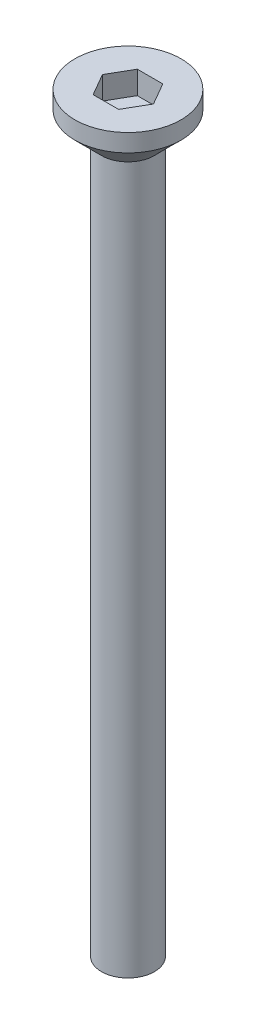
ISO-10303-21;
HEADER;
FILE_DESCRIPTION(('STEP AP214'),'2;1');
FILE_NAME('part.step','',(''),(''),'','','');
FILE_SCHEMA(('AUTOMOTIVE_DESIGN { 1 0 10303 214 1 1 1 1 }'));
ENDSEC;
DATA;
#1=APPLICATION_CONTEXT('core data for automotive mechanical design processes');
#2=APPLICATION_PROTOCOL_DEFINITION('international standard','automotive_design',2000,#1);
#3=PRODUCT_CONTEXT('',#1,'mechanical');
#4=PRODUCT('Part','Part','',(#3));
#5=PRODUCT_RELATED_PRODUCT_CATEGORY('part','',(#4));
#6=PRODUCT_DEFINITION_FORMATION('','',#4);
#7=PRODUCT_DEFINITION_CONTEXT('part definition',#1,'design');
#8=PRODUCT_DEFINITION('design','',#6,#7);
#9=PRODUCT_DEFINITION_SHAPE('','',#8);
#10=(LENGTH_UNIT() NAMED_UNIT(*) SI_UNIT(.MILLI.,.METRE.));
#11=(NAMED_UNIT(*) PLANE_ANGLE_UNIT() SI_UNIT($,.RADIAN.));
#12=(NAMED_UNIT(*) SI_UNIT($,.STERADIAN.) SOLID_ANGLE_UNIT());
#13=UNCERTAINTY_MEASURE_WITH_UNIT(LENGTH_MEASURE(1.E-05),#10,'distance_accuracy_value','');
#14=(GEOMETRIC_REPRESENTATION_CONTEXT(3) GLOBAL_UNCERTAINTY_ASSIGNED_CONTEXT((#13)) GLOBAL_UNIT_ASSIGNED_CONTEXT((#10,
#11,#12)) REPRESENTATION_CONTEXT('',''));
#15=CARTESIAN_POINT('',(0.,0.,0.));
#16=DIRECTION('',(0.,0.,1.));
#17=DIRECTION('',(1.,0.,0.));
#18=AXIS2_PLACEMENT_3D('',#15,#16,#17);
#19=CARTESIAN_POINT('',(0.,2.5,0.));
#20=DIRECTION('',(0.,-1.,0.));
#21=DIRECTION('',(0.,0.,-1.));
#22=AXIS2_PLACEMENT_3D('',#19,#20,#21);
#23=CYLINDRICAL_SURFACE('',#22,3.);
#24=CARTESIAN_POINT('',(0.,1.5,0.));
#25=DIRECTION('',(0.,1.,0.));
#26=DIRECTION('',(0.,0.,1.));
#27=AXIS2_PLACEMENT_3D('',#24,#25,#26);
#28=CIRCLE('',#27,3.);
#29=CARTESIAN_POINT('',(0.,1.5,3.));
#30=VERTEX_POINT('',#29);
#31=EDGE_CURVE('E45',#30,#30,#28,.T.);
#32=ORIENTED_EDGE('',*,*,#31,.T.);
#33=EDGE_LOOP('',(#32));
#34=FACE_BOUND('',#33,.T.);
#35=CARTESIAN_POINT('',(0.,2.5,0.));
#36=DIRECTION('',(0.,1.,0.));
#37=DIRECTION('',(0.,0.,1.));
#38=AXIS2_PLACEMENT_3D('',#35,#36,#37);
#39=CIRCLE('',#38,3.);
#40=CARTESIAN_POINT('',(0.,2.5,3.));
#41=VERTEX_POINT('',#40);
#42=EDGE_CURVE('E140',#41,#41,#39,.T.);
#43=ORIENTED_EDGE('',*,*,#42,.F.);
#44=EDGE_LOOP('',(#43));
#45=FACE_BOUND('',#44,.T.);
#46=ADVANCED_FACE('F37',(#34,#45),#23,.T.);
#47=CARTESIAN_POINT('',(0.,2.5,0.));
#48=DIRECTION('',(0.,1.,0.));
#49=DIRECTION('',(0.,0.,1.));
#50=AXIS2_PLACEMENT_3D('',#47,#48,#49);
#51=PLANE('',#50);
#52=DIRECTION('',(0.5,0.,-0.866025403784439));
#53=VECTOR('',#52,1.);
#54=CARTESIAN_POINT('',(0.721687836487032,2.5,1.25));
#55=LINE('',#54,#53);
#56=CARTESIAN_POINT('',(0.721687836487032,2.5,1.25));
#57=VERTEX_POINT('',#56);
#58=CARTESIAN_POINT('',(1.44337567297406,2.5,0.));
#59=VERTEX_POINT('',#58);
#60=EDGE_CURVE('E52',#57,#59,#55,.T.);
#61=ORIENTED_EDGE('',*,*,#60,.F.);
#62=DIRECTION('',(1.,0.,0.));
#63=VECTOR('',#62,1.);
#64=CARTESIAN_POINT('',(-0.721687836487033,2.5,1.25));
#65=LINE('',#64,#63);
#66=CARTESIAN_POINT('',(-0.721687836487033,2.5,1.25));
#67=VERTEX_POINT('',#66);
#68=EDGE_CURVE('E136',#67,#57,#65,.T.);
#69=ORIENTED_EDGE('',*,*,#68,.F.);
#70=DIRECTION('',(0.5,0.,0.866025403784439));
#71=VECTOR('',#70,1.);
#72=CARTESIAN_POINT('',(-1.44337567297407,2.5,0.));
#73=LINE('',#72,#71);
#74=CARTESIAN_POINT('',(-1.44337567297407,2.5,0.));
#75=VERTEX_POINT('',#74);
#76=EDGE_CURVE('E134',#75,#67,#73,.T.);
#77=ORIENTED_EDGE('',*,*,#76,.F.);
#78=DIRECTION('',(-0.5,0.,0.866025403784438));
#79=VECTOR('',#78,1.);
#80=CARTESIAN_POINT('',(-0.721687836487033,2.5,-1.25));
#81=LINE('',#80,#79);
#82=CARTESIAN_POINT('',(-0.721687836487033,2.5,-1.25));
#83=VERTEX_POINT('',#82);
#84=EDGE_CURVE('E100',#83,#75,#81,.T.);
#85=ORIENTED_EDGE('',*,*,#84,.F.);
#86=DIRECTION('',(-1.,0.,0.));
#87=VECTOR('',#86,1.);
#88=CARTESIAN_POINT('',(0.721687836487032,2.5,-1.25));
#89=LINE('',#88,#87);
#90=CARTESIAN_POINT('',(0.721687836487032,2.5,-1.25));
#91=VERTEX_POINT('',#90);
#92=EDGE_CURVE('E130',#91,#83,#89,.T.);
#93=ORIENTED_EDGE('',*,*,#92,.F.);
#94=DIRECTION('',(-0.5,0.,-0.866025403784439));
#95=VECTOR('',#94,1.);
#96=CARTESIAN_POINT('',(1.44337567297406,2.5,0.));
#97=LINE('',#96,#95);
#98=EDGE_CURVE('E126',#59,#91,#97,.T.);
#99=ORIENTED_EDGE('',*,*,#98,.F.);
#100=EDGE_LOOP('',(#61,#69,#77,#85,#93,#99));
#101=FACE_BOUND('',#100,.T.);
#102=ORIENTED_EDGE('',*,*,#42,.T.);
#103=EDGE_LOOP('',(#102));
#104=FACE_BOUND('',#103,.T.);
#105=ADVANCED_FACE('F154',(#101,#104),#51,.T.);
#106=CARTESIAN_POINT('',(0.,1.5,0.));
#107=DIRECTION('',(0.,1.,0.));
#108=DIRECTION('',(0.,0.,1.));
#109=AXIS2_PLACEMENT_3D('',#106,#107,#108);
#110=CONICAL_SURFACE('',#109,3.,0.78539816339745);
#111=CARTESIAN_POINT('',(0.,0.,0.));
#112=DIRECTION('',(0.,1.,0.));
#113=DIRECTION('',(0.,0.,1.));
#114=AXIS2_PLACEMENT_3D('',#111,#112,#113);
#115=CIRCLE('',#114,1.49999999999999);
#116=CARTESIAN_POINT('',(0.,0.,1.49999999999999));
#117=VERTEX_POINT('',#116);
#118=EDGE_CURVE('E11',#117,#117,#115,.F.);
#119=ORIENTED_EDGE('',*,*,#118,.F.);
#120=EDGE_LOOP('',(#119));
#121=FACE_BOUND('',#120,.T.);
#122=ORIENTED_EDGE('',*,*,#31,.F.);
#123=EDGE_LOOP('',(#122));
#124=FACE_BOUND('',#123,.T.);
#125=ADVANCED_FACE('F39',(#121,#124),#110,.T.);
#126=CARTESIAN_POINT('',(0.721687836487032,1.2,1.25));
#127=DIRECTION('',(0.866025403784439,0.,0.5));
#128=DIRECTION('',(0.5,0.,-0.866025403784439));
#129=AXIS2_PLACEMENT_3D('',#126,#127,#128);
#130=PLANE('',#129);
#131=ORIENTED_EDGE('',*,*,#60,.T.);
#132=DIRECTION('',(0.,1.,0.));
#133=VECTOR('',#132,1.);
#134=CARTESIAN_POINT('',(1.44337567297406,1.2,0.));
#135=LINE('',#134,#133);
#136=CARTESIAN_POINT('',(1.44337567297406,1.2,0.));
#137=VERTEX_POINT('',#136);
#138=EDGE_CURVE('E82',#137,#59,#135,.T.);
#139=ORIENTED_EDGE('',*,*,#138,.F.);
#140=DIRECTION('',(0.5,0.,-0.866025403784439));
#141=VECTOR('',#140,1.);
#142=CARTESIAN_POINT('',(0.721687836487032,1.2,1.25));
#143=LINE('',#142,#141);
#144=CARTESIAN_POINT('',(0.721687836487032,1.2,1.25));
#145=VERTEX_POINT('',#144);
#146=EDGE_CURVE('E138',#145,#137,#143,.T.);
#147=ORIENTED_EDGE('',*,*,#146,.F.);
#148=DIRECTION('',(0.,1.,0.));
#149=VECTOR('',#148,1.);
#150=CARTESIAN_POINT('',(0.721687836487032,1.2,1.25));
#151=LINE('',#150,#149);
#152=EDGE_CURVE('E60',#145,#57,#151,.T.);
#153=ORIENTED_EDGE('',*,*,#152,.T.);
#154=EDGE_LOOP('',(#131,#139,#147,#153));
#155=FACE_BOUND('',#154,.T.);
#156=ADVANCED_FACE('F153',(#155),#130,.F.);
#157=CARTESIAN_POINT('',(-0.721687836487033,1.2,1.25));
#158=DIRECTION('',(0.,0.,1.));
#159=DIRECTION('',(1.,0.,0.));
#160=AXIS2_PLACEMENT_3D('',#157,#158,#159);
#161=PLANE('',#160);
#162=ORIENTED_EDGE('',*,*,#68,.T.);
#163=ORIENTED_EDGE('',*,*,#152,.F.);
#164=DIRECTION('',(1.,0.,0.));
#165=VECTOR('',#164,1.);
#166=CARTESIAN_POINT('',(-0.721687836487033,1.2,1.25));
#167=LINE('',#166,#165);
#168=CARTESIAN_POINT('',(-0.721687836487033,1.2,1.25));
#169=VERTEX_POINT('',#168);
#170=EDGE_CURVE('E112',#169,#145,#167,.T.);
#171=ORIENTED_EDGE('',*,*,#170,.F.);
#172=DIRECTION('',(0.,1.,0.));
#173=VECTOR('',#172,1.);
#174=CARTESIAN_POINT('',(-0.721687836487033,1.2,1.25));
#175=LINE('',#174,#173);
#176=EDGE_CURVE('E104',#169,#67,#175,.T.);
#177=ORIENTED_EDGE('',*,*,#176,.T.);
#178=EDGE_LOOP('',(#162,#163,#171,#177));
#179=FACE_BOUND('',#178,.T.);
#180=ADVANCED_FACE('F160',(#179),#161,.F.);
#181=CARTESIAN_POINT('',(-1.44337567297407,1.2,0.));
#182=DIRECTION('',(-0.866025403784439,0.,0.5));
#183=DIRECTION('',(0.5,0.,0.866025403784439));
#184=AXIS2_PLACEMENT_3D('',#181,#182,#183);
#185=PLANE('',#184);
#186=ORIENTED_EDGE('',*,*,#76,.T.);
#187=ORIENTED_EDGE('',*,*,#176,.F.);
#188=DIRECTION('',(0.5,0.,0.866025403784439));
#189=VECTOR('',#188,1.);
#190=CARTESIAN_POINT('',(-1.44337567297407,1.2,0.));
#191=LINE('',#190,#189);
#192=CARTESIAN_POINT('',(-1.44337567297407,1.2,0.));
#193=VERTEX_POINT('',#192);
#194=EDGE_CURVE('E108',#193,#169,#191,.T.);
#195=ORIENTED_EDGE('',*,*,#194,.F.);
#196=DIRECTION('',(0.,1.,0.));
#197=VECTOR('',#196,1.);
#198=CARTESIAN_POINT('',(-1.44337567297407,1.2,0.));
#199=LINE('',#198,#197);
#200=EDGE_CURVE('E93',#193,#75,#199,.T.);
#201=ORIENTED_EDGE('',*,*,#200,.T.);
#202=EDGE_LOOP('',(#186,#187,#195,#201));
#203=FACE_BOUND('',#202,.T.);
#204=ADVANCED_FACE('F109',(#203),#185,.F.);
#205=CARTESIAN_POINT('',(-0.721687836487033,1.2,-1.25));
#206=DIRECTION('',(-0.866025403784439,0.,-0.5));
#207=DIRECTION('',(-0.5,0.,0.866025403784439));
#208=AXIS2_PLACEMENT_3D('',#205,#206,#207);
#209=PLANE('',#208);
#210=ORIENTED_EDGE('',*,*,#84,.T.);
#211=ORIENTED_EDGE('',*,*,#200,.F.);
#212=DIRECTION('',(-0.5,0.,0.866025403784438));
#213=VECTOR('',#212,1.);
#214=CARTESIAN_POINT('',(-0.721687836487033,1.2,-1.25));
#215=LINE('',#214,#213);
#216=CARTESIAN_POINT('',(-0.721687836487033,1.2,-1.25));
#217=VERTEX_POINT('',#216);
#218=EDGE_CURVE('E97',#217,#193,#215,.T.);
#219=ORIENTED_EDGE('',*,*,#218,.F.);
#220=DIRECTION('',(0.,1.,0.));
#221=VECTOR('',#220,1.);
#222=CARTESIAN_POINT('',(-0.721687836487033,1.2,-1.25));
#223=LINE('',#222,#221);
#224=EDGE_CURVE('E105',#217,#83,#223,.T.);
#225=ORIENTED_EDGE('',*,*,#224,.T.);
#226=EDGE_LOOP('',(#210,#211,#219,#225));
#227=FACE_BOUND('',#226,.T.);
#228=ADVANCED_FACE('F95',(#227),#209,.F.);
#229=CARTESIAN_POINT('',(0.721687836487032,1.2,-1.25));
#230=DIRECTION('',(0.,0.,-1.));
#231=DIRECTION('',(-1.,0.,0.));
#232=AXIS2_PLACEMENT_3D('',#229,#230,#231);
#233=PLANE('',#232);
#234=ORIENTED_EDGE('',*,*,#92,.T.);
#235=ORIENTED_EDGE('',*,*,#224,.F.);
#236=DIRECTION('',(-1.,0.,0.));
#237=VECTOR('',#236,1.);
#238=CARTESIAN_POINT('',(0.721687836487032,1.2,-1.25));
#239=LINE('',#238,#237);
#240=CARTESIAN_POINT('',(0.721687836487032,1.2,-1.25));
#241=VERTEX_POINT('',#240);
#242=EDGE_CURVE('E118',#241,#217,#239,.T.);
#243=ORIENTED_EDGE('',*,*,#242,.F.);
#244=DIRECTION('',(0.,1.,0.));
#245=VECTOR('',#244,1.);
#246=CARTESIAN_POINT('',(0.721687836487032,1.2,-1.25));
#247=LINE('',#246,#245);
#248=EDGE_CURVE('E143',#241,#91,#247,.T.);
#249=ORIENTED_EDGE('',*,*,#248,.T.);
#250=EDGE_LOOP('',(#234,#235,#243,#249));
#251=FACE_BOUND('',#250,.T.);
#252=ADVANCED_FACE('F172',(#251),#233,.F.);
#253=CARTESIAN_POINT('',(1.44337567297406,1.2,0.));
#254=DIRECTION('',(0.866025403784439,0.,-0.5));
#255=DIRECTION('',(-0.5,0.,-0.866025403784439));
#256=AXIS2_PLACEMENT_3D('',#253,#254,#255);
#257=PLANE('',#256);
#258=ORIENTED_EDGE('',*,*,#98,.T.);
#259=ORIENTED_EDGE('',*,*,#248,.F.);
#260=DIRECTION('',(-0.5,0.,-0.866025403784439));
#261=VECTOR('',#260,1.);
#262=CARTESIAN_POINT('',(1.44337567297406,1.2,0.));
#263=LINE('',#262,#261);
#264=EDGE_CURVE('E120',#137,#241,#263,.T.);
#265=ORIENTED_EDGE('',*,*,#264,.F.);
#266=ORIENTED_EDGE('',*,*,#138,.T.);
#267=EDGE_LOOP('',(#258,#259,#265,#266));
#268=FACE_BOUND('',#267,.T.);
#269=ADVANCED_FACE('F169',(#268),#257,.F.);
#270=CARTESIAN_POINT('',(0.,1.2,0.));
#271=DIRECTION('',(0.,1.,0.));
#272=DIRECTION('',(0.,0.,1.));
#273=AXIS2_PLACEMENT_3D('',#270,#271,#272);
#274=PLANE('',#273);
#275=ORIENTED_EDGE('',*,*,#146,.T.);
#276=ORIENTED_EDGE('',*,*,#264,.T.);
#277=ORIENTED_EDGE('',*,*,#242,.T.);
#278=ORIENTED_EDGE('',*,*,#218,.T.);
#279=ORIENTED_EDGE('',*,*,#194,.T.);
#280=ORIENTED_EDGE('',*,*,#170,.T.);
#281=EDGE_LOOP('',(#275,#276,#277,#278,#279,#280));
#282=FACE_BOUND('',#281,.T.);
#283=ADVANCED_FACE('F115',(#282),#274,.T.);
#284=CARTESIAN_POINT('',(0.,-40.,0.));
#285=DIRECTION('',(0.,1.,0.));
#286=DIRECTION('',(0.,0.,1.));
#287=AXIS2_PLACEMENT_3D('',#284,#285,#286);
#288=CYLINDRICAL_SURFACE('',#287,1.5);
#289=CARTESIAN_POINT('',(0.,-40.,0.));
#290=DIRECTION('',(0.,-1.,0.));
#291=DIRECTION('',(0.,0.,-1.));
#292=AXIS2_PLACEMENT_3D('',#289,#290,#291);
#293=CIRCLE('',#292,1.5);
#294=CARTESIAN_POINT('',(0.,-40.,-1.5));
#295=VERTEX_POINT('',#294);
#296=EDGE_CURVE('E127',#295,#295,#293,.T.);
#297=ORIENTED_EDGE('',*,*,#296,.F.);
#298=EDGE_LOOP('',(#297));
#299=FACE_BOUND('',#298,.T.);
#300=ORIENTED_EDGE('',*,*,#118,.T.);
#301=EDGE_LOOP('',(#300));
#302=FACE_BOUND('',#301,.T.);
#303=ADVANCED_FACE('F185',(#299,#302),#288,.T.);
#304=CARTESIAN_POINT('',(0.,-40.,0.));
#305=DIRECTION('',(0.,-1.,0.));
#306=DIRECTION('',(0.,0.,-1.));
#307=AXIS2_PLACEMENT_3D('',#304,#305,#306);
#308=PLANE('',#307);
#309=ORIENTED_EDGE('',*,*,#296,.T.);
#310=EDGE_LOOP('',(#309));
#311=FACE_BOUND('',#310,.T.);
#312=ADVANCED_FACE('F188',(#311),#308,.T.);
#313=CLOSED_SHELL('',(#46,#105,#125,#156,#180,#204,#228,#252,#269,#283,#303,#312));
#314=MANIFOLD_SOLID_BREP('B2',#313);
#315=ADVANCED_BREP_SHAPE_REPRESENTATION('',(#18,#314),#14);
#316=SHAPE_DEFINITION_REPRESENTATION(#9,#315);
ENDSEC;
END-ISO-10303-21;
